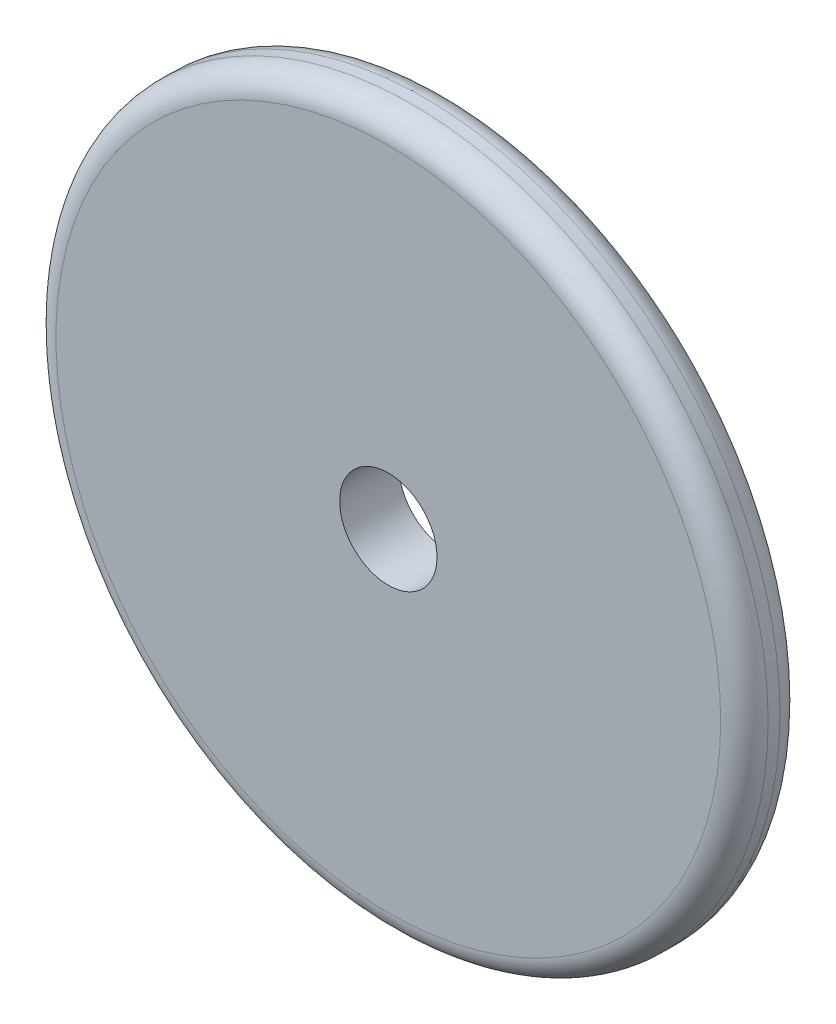
ISO-10303-21;
HEADER;
FILE_DESCRIPTION(('STEP AP214'),'2;1');
FILE_NAME('part.step','',(''),(''),'','','');
FILE_SCHEMA(('AUTOMOTIVE_DESIGN { 1 0 10303 214 1 1 1 1 }'));
ENDSEC;
DATA;
#1=APPLICATION_CONTEXT('core data for automotive mechanical design processes');
#2=APPLICATION_PROTOCOL_DEFINITION('international standard','automotive_design',2000,#1);
#3=PRODUCT_CONTEXT('',#1,'mechanical');
#4=PRODUCT('Part','Part','',(#3));
#5=PRODUCT_RELATED_PRODUCT_CATEGORY('part','',(#4));
#6=PRODUCT_DEFINITION_FORMATION('','',#4);
#7=PRODUCT_DEFINITION_CONTEXT('part definition',#1,'design');
#8=PRODUCT_DEFINITION('design','',#6,#7);
#9=PRODUCT_DEFINITION_SHAPE('','',#8);
#10=(LENGTH_UNIT() NAMED_UNIT(*) SI_UNIT(.MILLI.,.METRE.));
#11=(NAMED_UNIT(*) PLANE_ANGLE_UNIT() SI_UNIT($,.RADIAN.));
#12=(NAMED_UNIT(*) SI_UNIT($,.STERADIAN.) SOLID_ANGLE_UNIT());
#13=UNCERTAINTY_MEASURE_WITH_UNIT(LENGTH_MEASURE(1.E-05),#10,'distance_accuracy_value','');
#14=(GEOMETRIC_REPRESENTATION_CONTEXT(3) GLOBAL_UNCERTAINTY_ASSIGNED_CONTEXT((#13)) GLOBAL_UNIT_ASSIGNED_CONTEXT((#10,
#11,#12)) REPRESENTATION_CONTEXT('',''));
#15=CARTESIAN_POINT('',(0.,0.,0.));
#16=DIRECTION('',(0.,0.,1.));
#17=DIRECTION('',(1.,0.,0.));
#18=AXIS2_PLACEMENT_3D('',#15,#16,#17);
#19=CARTESIAN_POINT('',(0.,0.,2.5));
#20=DIRECTION('',(0.,0.,1.));
#21=DIRECTION('',(1.,0.,0.));
#22=AXIS2_PLACEMENT_3D('',#19,#20,#21);
#23=PLANE('',#22);
#24=CARTESIAN_POINT('',(0.,0.,2.5));
#25=DIRECTION('',(0.,0.,1.));
#26=DIRECTION('',(1.,0.,0.));
#27=AXIS2_PLACEMENT_3D('',#24,#25,#26);
#28=CIRCLE('',#27,28.);
#29=CARTESIAN_POINT('',(28.,0.,2.5));
#30=VERTEX_POINT('',#29);
#31=EDGE_CURVE('E10',#30,#30,#28,.T.);
#32=ORIENTED_EDGE('',*,*,#31,.T.);
#33=EDGE_LOOP('',(#32));
#34=FACE_BOUND('',#33,.T.);
#35=CARTESIAN_POINT('',(0.,0.,2.5));
#36=DIRECTION('',(0.,0.,1.));
#37=DIRECTION('',(1.,0.,0.));
#38=AXIS2_PLACEMENT_3D('',#35,#36,#37);
#39=CIRCLE('',#38,4.1);
#40=CARTESIAN_POINT('',(4.1,0.,2.5));
#41=VERTEX_POINT('',#40);
#42=EDGE_CURVE('E53',#41,#41,#39,.T.);
#43=ORIENTED_EDGE('',*,*,#42,.F.);
#44=EDGE_LOOP('',(#43));
#45=FACE_BOUND('',#44,.T.);
#46=ADVANCED_FACE('F33',(#34,#45),#23,.T.);
#47=CARTESIAN_POINT('',(0.,0.,-2.5));
#48=DIRECTION('',(0.,0.,1.));
#49=DIRECTION('',(1.,0.,0.));
#50=AXIS2_PLACEMENT_3D('',#47,#48,#49);
#51=PLANE('',#50);
#52=CARTESIAN_POINT('',(0.,0.,-2.5));
#53=DIRECTION('',(0.,0.,1.));
#54=DIRECTION('',(1.,0.,0.));
#55=AXIS2_PLACEMENT_3D('',#52,#53,#54);
#56=CIRCLE('',#55,28.);
#57=CARTESIAN_POINT('',(28.,0.,-2.5));
#58=VERTEX_POINT('',#57);
#59=EDGE_CURVE('E40',#58,#58,#56,.F.);
#60=ORIENTED_EDGE('',*,*,#59,.T.);
#61=EDGE_LOOP('',(#60));
#62=FACE_BOUND('',#61,.T.);
#63=CARTESIAN_POINT('',(0.,0.,-2.5));
#64=DIRECTION('',(0.,0.,1.));
#65=DIRECTION('',(1.,0.,0.));
#66=AXIS2_PLACEMENT_3D('',#63,#64,#65);
#67=CIRCLE('',#66,4.1);
#68=CARTESIAN_POINT('',(4.1,0.,-2.5));
#69=VERTEX_POINT('',#68);
#70=EDGE_CURVE('E54',#69,#69,#67,.T.);
#71=ORIENTED_EDGE('',*,*,#70,.T.);
#72=EDGE_LOOP('',(#71));
#73=FACE_BOUND('',#72,.T.);
#74=ADVANCED_FACE('F64',(#62,#73),#51,.F.);
#75=CARTESIAN_POINT('',(0.,0.,2.5));
#76=DIRECTION('',(0.,0.,-1.));
#77=DIRECTION('',(-1.,0.,0.));
#78=AXIS2_PLACEMENT_3D('',#75,#76,#77);
#79=CYLINDRICAL_SURFACE('',#78,30.);
#80=CARTESIAN_POINT('',(0.,0.,-0.5));
#81=DIRECTION('',(0.,0.,1.));
#82=DIRECTION('',(1.,0.,0.));
#83=AXIS2_PLACEMENT_3D('',#80,#81,#82);
#84=CIRCLE('',#83,30.);
#85=CARTESIAN_POINT('',(30.,0.,-0.5));
#86=VERTEX_POINT('',#85);
#87=EDGE_CURVE('E44',#86,#86,#84,.T.);
#88=ORIENTED_EDGE('',*,*,#87,.T.);
#89=EDGE_LOOP('',(#88));
#90=FACE_BOUND('',#89,.T.);
#91=CARTESIAN_POINT('',(0.,0.,0.5));
#92=DIRECTION('',(0.,0.,1.));
#93=DIRECTION('',(1.,0.,0.));
#94=AXIS2_PLACEMENT_3D('',#91,#92,#93);
#95=CIRCLE('',#94,30.);
#96=CARTESIAN_POINT('',(30.,0.,0.5));
#97=VERTEX_POINT('',#96);
#98=EDGE_CURVE('E48',#97,#97,#95,.F.);
#99=ORIENTED_EDGE('',*,*,#98,.T.);
#100=EDGE_LOOP('',(#99));
#101=FACE_BOUND('',#100,.T.);
#102=ADVANCED_FACE('F69',(#90,#101),#79,.T.);
#103=CARTESIAN_POINT('',(0.,0.,2.5));
#104=DIRECTION('',(0.,0.,-1.));
#105=DIRECTION('',(-1.,0.,0.));
#106=AXIS2_PLACEMENT_3D('',#103,#104,#105);
#107=CYLINDRICAL_SURFACE('',#106,4.1);
#108=ORIENTED_EDGE('',*,*,#42,.T.);
#109=EDGE_LOOP('',(#108));
#110=FACE_BOUND('',#109,.T.);
#111=ORIENTED_EDGE('',*,*,#70,.F.);
#112=EDGE_LOOP('',(#111));
#113=FACE_BOUND('',#112,.T.);
#114=ADVANCED_FACE('F60',(#110,#113),#107,.F.);
#115=CARTESIAN_POINT('',(0.,0.,-0.5));
#116=DIRECTION('',(0.,0.,1.));
#117=DIRECTION('',(1.,0.,0.));
#118=AXIS2_PLACEMENT_3D('',#115,#116,#117);
#119=TOROIDAL_SURFACE('',#118,28.,2.);
#120=ORIENTED_EDGE('',*,*,#59,.F.);
#121=EDGE_LOOP('',(#120));
#122=FACE_BOUND('',#121,.T.);
#123=ORIENTED_EDGE('',*,*,#87,.F.);
#124=EDGE_LOOP('',(#123));
#125=FACE_BOUND('',#124,.T.);
#126=ADVANCED_FACE('F75',(#122,#125),#119,.T.);
#127=CARTESIAN_POINT('',(0.,0.,0.5));
#128=DIRECTION('',(0.,0.,1.));
#129=DIRECTION('',(1.,0.,0.));
#130=AXIS2_PLACEMENT_3D('',#127,#128,#129);
#131=TOROIDAL_SURFACE('',#130,28.,2.);
#132=ORIENTED_EDGE('',*,*,#98,.F.);
#133=EDGE_LOOP('',(#132));
#134=FACE_BOUND('',#133,.T.);
#135=ORIENTED_EDGE('',*,*,#31,.F.);
#136=EDGE_LOOP('',(#135));
#137=FACE_BOUND('',#136,.T.);
#138=ADVANCED_FACE('F35',(#134,#137),#131,.T.);
#139=CLOSED_SHELL('',(#46,#74,#102,#114,#126,#138));
#140=MANIFOLD_SOLID_BREP('B2',#139);
#141=ADVANCED_BREP_SHAPE_REPRESENTATION('',(#18,#140),#14);
#142=SHAPE_DEFINITION_REPRESENTATION(#9,#141);
ENDSEC;
END-ISO-10303-21;
